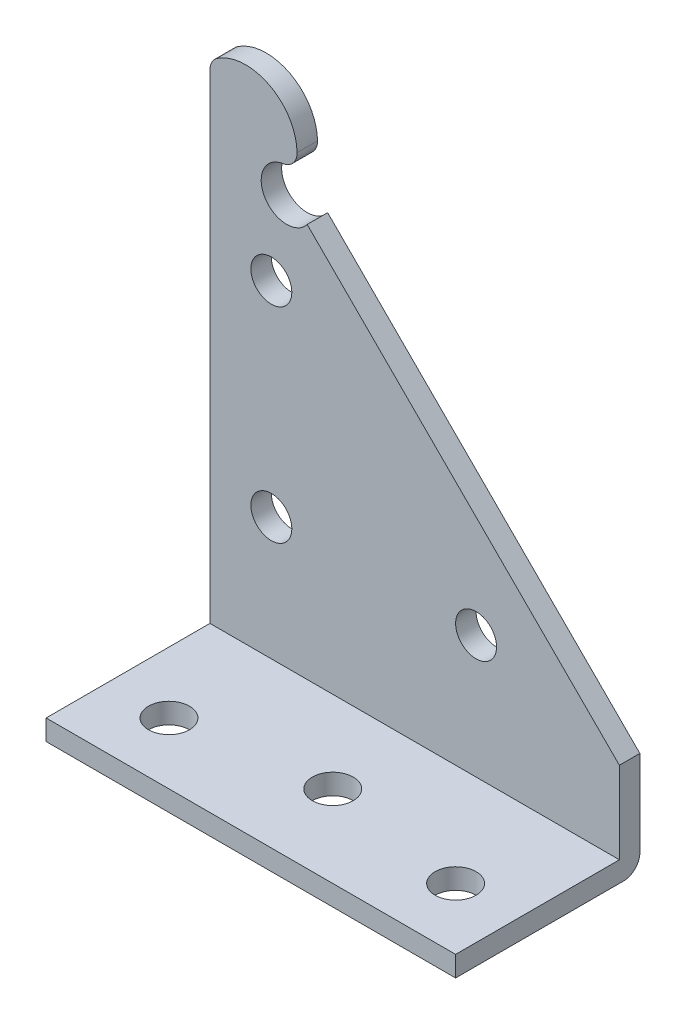
ISO-10303-21;
HEADER;
FILE_DESCRIPTION(('STEP AP214'),'2;1');
FILE_NAME('part.step','',(''),(''),'','','');
FILE_SCHEMA(('AUTOMOTIVE_DESIGN { 1 0 10303 214 1 1 1 1 }'));
ENDSEC;
DATA;
#1=APPLICATION_CONTEXT('core data for automotive mechanical design processes');
#2=APPLICATION_PROTOCOL_DEFINITION('international standard','automotive_design',2000,#1);
#3=PRODUCT_CONTEXT('',#1,'mechanical');
#4=PRODUCT('Part','Part','',(#3));
#5=PRODUCT_RELATED_PRODUCT_CATEGORY('part','',(#4));
#6=PRODUCT_DEFINITION_FORMATION('','',#4);
#7=PRODUCT_DEFINITION_CONTEXT('part definition',#1,'design');
#8=PRODUCT_DEFINITION('design','',#6,#7);
#9=PRODUCT_DEFINITION_SHAPE('','',#8);
#10=(LENGTH_UNIT() NAMED_UNIT(*) SI_UNIT(.MILLI.,.METRE.));
#11=(NAMED_UNIT(*) PLANE_ANGLE_UNIT() SI_UNIT($,.RADIAN.));
#12=(NAMED_UNIT(*) SI_UNIT($,.STERADIAN.) SOLID_ANGLE_UNIT());
#13=UNCERTAINTY_MEASURE_WITH_UNIT(LENGTH_MEASURE(1.E-05),#10,'distance_accuracy_value','');
#14=(GEOMETRIC_REPRESENTATION_CONTEXT(3) GLOBAL_UNCERTAINTY_ASSIGNED_CONTEXT((#13)) GLOBAL_UNIT_ASSIGNED_CONTEXT((#10,
#11,#12)) REPRESENTATION_CONTEXT('',''));
#15=CARTESIAN_POINT('',(0.,0.,0.));
#16=DIRECTION('',(0.,0.,1.));
#17=DIRECTION('',(1.,0.,0.));
#18=AXIS2_PLACEMENT_3D('',#15,#16,#17);
#19=CARTESIAN_POINT('',(-29.3624,44.45,3.175));
#20=DIRECTION('',(0.,0.,1.));
#21=DIRECTION('',(1.,0.,0.));
#22=AXIS2_PLACEMENT_3D('',#19,#20,#21);
#23=PLANE('',#22);
#24=DIRECTION('',(-1.,0.,0.));
#25=VECTOR('',#24,1.);
#26=CARTESIAN_POINT('',(-41.275,-19.05,3.175));
#27=LINE('',#26,#25);
#28=CARTESIAN_POINT('',(22.225,-19.05,3.175));
#29=VERTEX_POINT('',#28);
#30=CARTESIAN_POINT('',(-41.275,-19.05,3.175));
#31=VERTEX_POINT('',#30);
#32=EDGE_CURVE('E136',#29,#31,#27,.T.);
#33=ORIENTED_EDGE('',*,*,#32,.F.);
#34=DIRECTION('',(0.,1.,0.));
#35=VECTOR('',#34,1.);
#36=CARTESIAN_POINT('',(22.225,-22.225,3.175));
#37=LINE('',#36,#35);
#38=CARTESIAN_POINT('',(22.225,-6.34999999999999,3.175));
#39=VERTEX_POINT('',#38);
#40=EDGE_CURVE('E168',#29,#39,#37,.T.);
#41=ORIENTED_EDGE('',*,*,#40,.T.);
#42=DIRECTION('',(-0.707106781186551,0.707106781186544,0.));
#43=VECTOR('',#42,1.);
#44=CARTESIAN_POINT('',(22.225,-6.34999999999999,3.175));
#45=LINE('',#44,#43);
#46=CARTESIAN_POINT('',(-26.1946583294408,42.0696583294403,3.175));
#47=VERTEX_POINT('',#46);
#48=EDGE_CURVE('E170',#39,#47,#45,.T.);
#49=ORIENTED_EDGE('',*,*,#48,.T.);
#50=CARTESIAN_POINT('',(-29.3624,44.45,3.175));
#51=DIRECTION('',(0.,0.,-1.));
#52=DIRECTION('',(1.,0.,0.));
#53=AXIS2_PLACEMENT_3D('',#50,#51,#52);
#54=CIRCLE('',#53,3.9624);
#55=CARTESIAN_POINT('',(-29.9354883165363,48.3707376272137,3.175));
#56=VERTEX_POINT('',#55);
#57=EDGE_CURVE('E173',#47,#56,#54,.T.);
#58=ORIENTED_EDGE('',*,*,#57,.T.);
#59=CARTESIAN_POINT('',(-30.3028526220082,50.8840309779918,3.175));
#60=DIRECTION('',(0.,0.,1.));
#61=DIRECTION('',(1.,0.,0.));
#62=AXIS2_PLACEMENT_3D('',#59,#60,#61);
#63=CIRCLE('',#62,2.54);
#64=CARTESIAN_POINT('',(-27.7631590173173,50.9234821413682,3.175));
#65=VERTEX_POINT('',#64);
#66=EDGE_CURVE('E175',#56,#65,#63,.T.);
#67=ORIENTED_EDGE('',*,*,#66,.T.);
#68=CARTESIAN_POINT('',(-35.7124,50.8,3.175));
#69=DIRECTION('',(0.,0.,1.));
#70=DIRECTION('',(1.,0.,0.));
#71=AXIS2_PLACEMENT_3D('',#68,#69,#70);
#72=CIRCLE('',#71,7.95019999999999);
#73=CARTESIAN_POINT('',(-40.1540610328639,57.3937339428535,3.175));
#74=VERTEX_POINT('',#73);
#75=EDGE_CURVE('E177',#65,#74,#72,.T.);
#76=ORIENTED_EDGE('',*,*,#75,.T.);
#77=CARTESIAN_POINT('',(-38.735,55.287109679961,3.175));
#78=DIRECTION('',(0.,0.,1.));
#79=DIRECTION('',(-1.,0.,0.));
#80=AXIS2_PLACEMENT_3D('',#77,#78,#79);
#81=CIRCLE('',#80,2.54);
#82=CARTESIAN_POINT('',(-41.275,55.287109679961,3.175));
#83=VERTEX_POINT('',#82);
#84=EDGE_CURVE('E179',#74,#83,#81,.T.);
#85=ORIENTED_EDGE('',*,*,#84,.T.);
#86=DIRECTION('',(0.,-1.,0.));
#87=VECTOR('',#86,1.);
#88=CARTESIAN_POINT('',(-41.275,55.287109679961,3.175));
#89=LINE('',#88,#87);
#90=EDGE_CURVE('E181',#83,#31,#89,.T.);
#91=ORIENTED_EDGE('',*,*,#90,.T.);
#92=EDGE_LOOP('',(#33,#41,#49,#58,#67,#76,#85,#91));
#93=FACE_BOUND('',#92,.T.);
#94=CARTESIAN_POINT('',(-31.75,0.,3.175));
#95=DIRECTION('',(0.,0.,1.));
#96=DIRECTION('',(1.,0.,0.));
#97=AXIS2_PLACEMENT_3D('',#94,#95,#96);
#98=CIRCLE('',#97,3.175);
#99=CARTESIAN_POINT('',(-28.575,0.,3.175));
#100=VERTEX_POINT('',#99);
#101=EDGE_CURVE('E156',#100,#100,#98,.T.);
#102=ORIENTED_EDGE('',*,*,#101,.F.);
#103=EDGE_LOOP('',(#102));
#104=FACE_BOUND('',#103,.T.);
#105=CARTESIAN_POINT('',(0.,0.,3.175));
#106=DIRECTION('',(0.,0.,1.));
#107=DIRECTION('',(1.,0.,0.));
#108=AXIS2_PLACEMENT_3D('',#105,#106,#107);
#109=CIRCLE('',#108,3.175);
#110=CARTESIAN_POINT('',(3.175,0.,3.175));
#111=VERTEX_POINT('',#110);
#112=EDGE_CURVE('E162',#111,#111,#109,.T.);
#113=ORIENTED_EDGE('',*,*,#112,.F.);
#114=EDGE_LOOP('',(#113));
#115=FACE_BOUND('',#114,.T.);
#116=CARTESIAN_POINT('',(-31.75,31.75,3.175));
#117=DIRECTION('',(0.,0.,1.));
#118=DIRECTION('',(1.,0.,0.));
#119=AXIS2_PLACEMENT_3D('',#116,#117,#118);
#120=CIRCLE('',#119,3.175);
#121=CARTESIAN_POINT('',(-28.575,31.75,3.175));
#122=VERTEX_POINT('',#121);
#123=EDGE_CURVE('E148',#122,#122,#120,.T.);
#124=ORIENTED_EDGE('',*,*,#123,.F.);
#125=EDGE_LOOP('',(#124));
#126=FACE_BOUND('',#125,.T.);
#127=ADVANCED_FACE('F36',(#93,#104,#115,#126),#23,.T.);
#128=CARTESIAN_POINT('',(-29.3624,44.45,0.));
#129=DIRECTION('',(0.,0.,1.));
#130=DIRECTION('',(1.,0.,0.));
#131=AXIS2_PLACEMENT_3D('',#128,#129,#130);
#132=PLANE('',#131);
#133=DIRECTION('',(0.,1.,0.));
#134=VECTOR('',#133,1.);
#135=CARTESIAN_POINT('',(22.225,-22.225,0.));
#136=LINE('',#135,#134);
#137=CARTESIAN_POINT('',(22.225,-19.685,0.));
#138=VERTEX_POINT('',#137);
#139=CARTESIAN_POINT('',(22.225,-6.34999999999999,0.));
#140=VERTEX_POINT('',#139);
#141=EDGE_CURVE('E165',#138,#140,#136,.T.);
#142=ORIENTED_EDGE('',*,*,#141,.F.);
#143=DIRECTION('',(1.,0.,0.));
#144=VECTOR('',#143,1.);
#145=CARTESIAN_POINT('',(-29.3624,-19.685,0.));
#146=LINE('',#145,#144);
#147=CARTESIAN_POINT('',(-41.275,-19.685,0.));
#148=VERTEX_POINT('',#147);
#149=EDGE_CURVE('E44',#138,#148,#146,.F.);
#150=ORIENTED_EDGE('',*,*,#149,.T.);
#151=DIRECTION('',(0.,-1.,0.));
#152=VECTOR('',#151,1.);
#153=CARTESIAN_POINT('',(-41.275,55.287109679961,0.));
#154=LINE('',#153,#152);
#155=CARTESIAN_POINT('',(-41.275,55.287109679961,0.));
#156=VERTEX_POINT('',#155);
#157=EDGE_CURVE('E171',#156,#148,#154,.T.);
#158=ORIENTED_EDGE('',*,*,#157,.F.);
#159=CARTESIAN_POINT('',(-38.735,55.287109679961,0.));
#160=DIRECTION('',(0.,0.,1.));
#161=DIRECTION('',(-1.,0.,0.));
#162=AXIS2_PLACEMENT_3D('',#159,#160,#161);
#163=CIRCLE('',#162,2.54);
#164=CARTESIAN_POINT('',(-40.1540610328639,57.3937339428535,0.));
#165=VERTEX_POINT('',#164);
#166=EDGE_CURVE('E193',#165,#156,#163,.T.);
#167=ORIENTED_EDGE('',*,*,#166,.F.);
#168=CARTESIAN_POINT('',(-35.7124,50.8,0.));
#169=DIRECTION('',(0.,0.,1.));
#170=DIRECTION('',(1.,0.,0.));
#171=AXIS2_PLACEMENT_3D('',#168,#169,#170);
#172=CIRCLE('',#171,7.95019999999999);
#173=CARTESIAN_POINT('',(-27.7631590173173,50.9234821413682,0.));
#174=VERTEX_POINT('',#173);
#175=EDGE_CURVE('E191',#174,#165,#172,.T.);
#176=ORIENTED_EDGE('',*,*,#175,.F.);
#177=CARTESIAN_POINT('',(-30.3028526220082,50.8840309779918,0.));
#178=DIRECTION('',(0.,0.,1.));
#179=DIRECTION('',(1.,0.,0.));
#180=AXIS2_PLACEMENT_3D('',#177,#178,#179);
#181=CIRCLE('',#180,2.54);
#182=CARTESIAN_POINT('',(-29.9354883165363,48.3707376272137,0.));
#183=VERTEX_POINT('',#182);
#184=EDGE_CURVE('E189',#183,#174,#181,.T.);
#185=ORIENTED_EDGE('',*,*,#184,.F.);
#186=CARTESIAN_POINT('',(-29.3624,44.45,0.));
#187=DIRECTION('',(0.,0.,-1.));
#188=DIRECTION('',(1.,0.,0.));
#189=AXIS2_PLACEMENT_3D('',#186,#187,#188);
#190=CIRCLE('',#189,3.9624);
#191=CARTESIAN_POINT('',(-26.1946583294408,42.0696583294403,0.));
#192=VERTEX_POINT('',#191);
#193=EDGE_CURVE('E187',#192,#183,#190,.T.);
#194=ORIENTED_EDGE('',*,*,#193,.F.);
#195=DIRECTION('',(-0.707106781186551,0.707106781186544,0.));
#196=VECTOR('',#195,1.);
#197=CARTESIAN_POINT('',(22.225,-6.34999999999999,0.));
#198=LINE('',#197,#196);
#199=EDGE_CURVE('E185',#140,#192,#198,.T.);
#200=ORIENTED_EDGE('',*,*,#199,.F.);
#201=EDGE_LOOP('',(#142,#150,#158,#167,#176,#185,#194,#200));
#202=FACE_BOUND('',#201,.T.);
#203=CARTESIAN_POINT('',(0.,0.,0.));
#204=DIRECTION('',(0.,0.,1.));
#205=DIRECTION('',(1.,0.,0.));
#206=AXIS2_PLACEMENT_3D('',#203,#204,#205);
#207=CIRCLE('',#206,3.175);
#208=CARTESIAN_POINT('',(3.175,0.,0.));
#209=VERTEX_POINT('',#208);
#210=EDGE_CURVE('E159',#209,#209,#207,.T.);
#211=ORIENTED_EDGE('',*,*,#210,.T.);
#212=EDGE_LOOP('',(#211));
#213=FACE_BOUND('',#212,.T.);
#214=CARTESIAN_POINT('',(-31.75,0.,0.));
#215=DIRECTION('',(0.,0.,1.));
#216=DIRECTION('',(1.,0.,0.));
#217=AXIS2_PLACEMENT_3D('',#214,#215,#216);
#218=CIRCLE('',#217,3.175);
#219=CARTESIAN_POINT('',(-28.575,0.,0.));
#220=VERTEX_POINT('',#219);
#221=EDGE_CURVE('E154',#220,#220,#218,.T.);
#222=ORIENTED_EDGE('',*,*,#221,.T.);
#223=EDGE_LOOP('',(#222));
#224=FACE_BOUND('',#223,.T.);
#225=CARTESIAN_POINT('',(-31.75,31.75,0.));
#226=DIRECTION('',(0.,0.,1.));
#227=DIRECTION('',(1.,0.,0.));
#228=AXIS2_PLACEMENT_3D('',#225,#226,#227);
#229=CIRCLE('',#228,3.175);
#230=CARTESIAN_POINT('',(-28.575,31.75,0.));
#231=VERTEX_POINT('',#230);
#232=EDGE_CURVE('E145',#231,#231,#229,.T.);
#233=ORIENTED_EDGE('',*,*,#232,.T.);
#234=EDGE_LOOP('',(#233));
#235=FACE_BOUND('',#234,.T.);
#236=ADVANCED_FACE('F271',(#202,#213,#224,#235),#132,.F.);
#237=CARTESIAN_POINT('',(22.225,-22.225,3.175));
#238=DIRECTION('',(-1.,0.,0.));
#239=DIRECTION('',(0.,0.,1.));
#240=AXIS2_PLACEMENT_3D('',#237,#238,#239);
#241=PLANE('',#240);
#242=DIRECTION('',(0.,0.,-1.));
#243=VECTOR('',#242,1.);
#244=CARTESIAN_POINT('',(22.225,-22.225,3.175));
#245=LINE('',#244,#243);
#246=CARTESIAN_POINT('',(22.225,-22.225,28.575));
#247=VERTEX_POINT('',#246);
#248=CARTESIAN_POINT('',(22.225,-22.225,2.54));
#249=VERTEX_POINT('',#248);
#250=EDGE_CURVE('E183',#247,#249,#245,.T.);
#251=ORIENTED_EDGE('',*,*,#250,.T.);
#252=CARTESIAN_POINT('',(22.225,-19.685,2.54));
#253=DIRECTION('',(-1.,0.,0.));
#254=DIRECTION('',(0.,0.,1.));
#255=AXIS2_PLACEMENT_3D('',#252,#253,#254);
#256=CIRCLE('',#255,2.54);
#257=EDGE_CURVE('E58',#249,#138,#256,.F.);
#258=ORIENTED_EDGE('',*,*,#257,.T.);
#259=ORIENTED_EDGE('',*,*,#141,.T.);
#260=DIRECTION('',(0.,0.,-1.));
#261=VECTOR('',#260,1.);
#262=CARTESIAN_POINT('',(22.225,-6.34999999999999,3.175));
#263=LINE('',#262,#261);
#264=EDGE_CURVE('E213',#39,#140,#263,.T.);
#265=ORIENTED_EDGE('',*,*,#264,.F.);
#266=ORIENTED_EDGE('',*,*,#40,.F.);
#267=DIRECTION('',(0.,0.,-1.));
#268=VECTOR('',#267,1.);
#269=CARTESIAN_POINT('',(22.225,-19.05,3.175));
#270=LINE('',#269,#268);
#271=CARTESIAN_POINT('',(22.225,-19.05,28.575));
#272=VERTEX_POINT('',#271);
#273=EDGE_CURVE('E129',#272,#29,#270,.T.);
#274=ORIENTED_EDGE('',*,*,#273,.F.);
#275=DIRECTION('',(0.,-1.,0.));
#276=VECTOR('',#275,1.);
#277=CARTESIAN_POINT('',(22.225,-19.05,28.575));
#278=LINE('',#277,#276);
#279=EDGE_CURVE('E125',#272,#247,#278,.T.);
#280=ORIENTED_EDGE('',*,*,#279,.T.);
#281=EDGE_LOOP('',(#251,#258,#259,#265,#266,#274,#280));
#282=FACE_BOUND('',#281,.T.);
#283=ADVANCED_FACE('F225',(#282),#241,.F.);
#284=CARTESIAN_POINT('',(22.225,-6.34999999999999,3.175));
#285=DIRECTION('',(-0.707106781186543,-0.707106781186551,0.));
#286=DIRECTION('',(0.707106781186551,-0.707106781186544,0.));
#287=AXIS2_PLACEMENT_3D('',#284,#285,#286);
#288=PLANE('',#287);
#289=ORIENTED_EDGE('',*,*,#199,.T.);
#290=DIRECTION('',(0.,0.,-1.));
#291=VECTOR('',#290,1.);
#292=CARTESIAN_POINT('',(-26.1946583294408,42.0696583294403,3.175));
#293=LINE('',#292,#291);
#294=EDGE_CURVE('E210',#47,#192,#293,.T.);
#295=ORIENTED_EDGE('',*,*,#294,.F.);
#296=ORIENTED_EDGE('',*,*,#48,.F.);
#297=ORIENTED_EDGE('',*,*,#264,.T.);
#298=EDGE_LOOP('',(#289,#295,#296,#297));
#299=FACE_BOUND('',#298,.T.);
#300=ADVANCED_FACE('F302',(#299),#288,.F.);
#301=CARTESIAN_POINT('',(-29.3624,44.45,3.175));
#302=DIRECTION('',(0.,0.,-1.));
#303=DIRECTION('',(-1.,0.,0.));
#304=AXIS2_PLACEMENT_3D('',#301,#302,#303);
#305=CYLINDRICAL_SURFACE('',#304,3.9624);
#306=ORIENTED_EDGE('',*,*,#193,.T.);
#307=DIRECTION('',(0.,0.,-1.));
#308=VECTOR('',#307,1.);
#309=CARTESIAN_POINT('',(-29.9354883165363,48.3707376272137,3.175));
#310=LINE('',#309,#308);
#311=EDGE_CURVE('E207',#56,#183,#310,.T.);
#312=ORIENTED_EDGE('',*,*,#311,.F.);
#313=ORIENTED_EDGE('',*,*,#57,.F.);
#314=ORIENTED_EDGE('',*,*,#294,.T.);
#315=EDGE_LOOP('',(#306,#312,#313,#314));
#316=FACE_BOUND('',#315,.T.);
#317=ADVANCED_FACE('F298',(#316),#305,.F.);
#318=CARTESIAN_POINT('',(-30.3028526220082,50.8840309779918,3.175));
#319=DIRECTION('',(0.,0.,-1.));
#320=DIRECTION('',(-1.,0.,0.));
#321=AXIS2_PLACEMENT_3D('',#318,#319,#320);
#322=CYLINDRICAL_SURFACE('',#321,2.54);
#323=ORIENTED_EDGE('',*,*,#184,.T.);
#324=DIRECTION('',(0.,0.,-1.));
#325=VECTOR('',#324,1.);
#326=CARTESIAN_POINT('',(-27.7631590173173,50.9234821413682,3.175));
#327=LINE('',#326,#325);
#328=EDGE_CURVE('E204',#65,#174,#327,.T.);
#329=ORIENTED_EDGE('',*,*,#328,.F.);
#330=ORIENTED_EDGE('',*,*,#66,.F.);
#331=ORIENTED_EDGE('',*,*,#311,.T.);
#332=EDGE_LOOP('',(#323,#329,#330,#331));
#333=FACE_BOUND('',#332,.T.);
#334=ADVANCED_FACE('F294',(#333),#322,.T.);
#335=CARTESIAN_POINT('',(-35.7124,50.8,3.175));
#336=DIRECTION('',(0.,0.,-1.));
#337=DIRECTION('',(-1.,0.,0.));
#338=AXIS2_PLACEMENT_3D('',#335,#336,#337);
#339=CYLINDRICAL_SURFACE('',#338,7.95019999999999);
#340=ORIENTED_EDGE('',*,*,#175,.T.);
#341=DIRECTION('',(0.,0.,-1.));
#342=VECTOR('',#341,1.);
#343=CARTESIAN_POINT('',(-40.1540610328639,57.3937339428535,3.175));
#344=LINE('',#343,#342);
#345=EDGE_CURVE('E201',#74,#165,#344,.T.);
#346=ORIENTED_EDGE('',*,*,#345,.F.);
#347=ORIENTED_EDGE('',*,*,#75,.F.);
#348=ORIENTED_EDGE('',*,*,#328,.T.);
#349=EDGE_LOOP('',(#340,#346,#347,#348));
#350=FACE_BOUND('',#349,.T.);
#351=ADVANCED_FACE('F290',(#350),#339,.T.);
#352=CARTESIAN_POINT('',(-38.735,55.287109679961,3.175));
#353=DIRECTION('',(0.,0.,-1.));
#354=DIRECTION('',(-1.,0.,0.));
#355=AXIS2_PLACEMENT_3D('',#352,#353,#354);
#356=CYLINDRICAL_SURFACE('',#355,2.54);
#357=ORIENTED_EDGE('',*,*,#166,.T.);
#358=DIRECTION('',(0.,0.,-1.));
#359=VECTOR('',#358,1.);
#360=CARTESIAN_POINT('',(-41.275,55.287109679961,3.175));
#361=LINE('',#360,#359);
#362=EDGE_CURVE('E198',#83,#156,#361,.T.);
#363=ORIENTED_EDGE('',*,*,#362,.F.);
#364=ORIENTED_EDGE('',*,*,#84,.F.);
#365=ORIENTED_EDGE('',*,*,#345,.T.);
#366=EDGE_LOOP('',(#357,#363,#364,#365));
#367=FACE_BOUND('',#366,.T.);
#368=ADVANCED_FACE('F287',(#367),#356,.T.);
#369=CARTESIAN_POINT('',(-41.275,55.287109679961,3.175));
#370=DIRECTION('',(1.,0.,0.));
#371=DIRECTION('',(0.,0.,-1.));
#372=AXIS2_PLACEMENT_3D('',#369,#370,#371);
#373=PLANE('',#372);
#374=ORIENTED_EDGE('',*,*,#157,.T.);
#375=CARTESIAN_POINT('',(-41.275,-19.685,2.54));
#376=DIRECTION('',(1.,0.,0.));
#377=DIRECTION('',(0.,0.,-1.));
#378=AXIS2_PLACEMENT_3D('',#375,#376,#377);
#379=CIRCLE('',#378,2.54);
#380=CARTESIAN_POINT('',(-41.275,-22.225,2.54));
#381=VERTEX_POINT('',#380);
#382=EDGE_CURVE('E11',#148,#381,#379,.F.);
#383=ORIENTED_EDGE('',*,*,#382,.T.);
#384=DIRECTION('',(0.,0.,-1.));
#385=VECTOR('',#384,1.);
#386=CARTESIAN_POINT('',(-41.275,-22.225,3.175));
#387=LINE('',#386,#385);
#388=CARTESIAN_POINT('',(-41.275,-22.225,28.575));
#389=VERTEX_POINT('',#388);
#390=EDGE_CURVE('E143',#389,#381,#387,.T.);
#391=ORIENTED_EDGE('',*,*,#390,.F.);
#392=DIRECTION('',(0.,-1.,0.));
#393=VECTOR('',#392,1.);
#394=CARTESIAN_POINT('',(-41.275,-19.05,28.575));
#395=LINE('',#394,#393);
#396=CARTESIAN_POINT('',(-41.275,-19.05,28.575));
#397=VERTEX_POINT('',#396);
#398=EDGE_CURVE('E123',#397,#389,#395,.T.);
#399=ORIENTED_EDGE('',*,*,#398,.F.);
#400=DIRECTION('',(0.,0.,1.));
#401=VECTOR('',#400,1.);
#402=CARTESIAN_POINT('',(-41.275,-19.05,3.175));
#403=LINE('',#402,#401);
#404=EDGE_CURVE('E130',#31,#397,#403,.T.);
#405=ORIENTED_EDGE('',*,*,#404,.F.);
#406=ORIENTED_EDGE('',*,*,#90,.F.);
#407=ORIENTED_EDGE('',*,*,#362,.T.);
#408=EDGE_LOOP('',(#374,#383,#391,#399,#405,#406,#407));
#409=FACE_BOUND('',#408,.T.);
#410=ADVANCED_FACE('F141',(#409),#373,.F.);
#411=CARTESIAN_POINT('',(-41.275,-22.225,3.175));
#412=DIRECTION('',(0.,1.,0.));
#413=DIRECTION('',(-1.,0.,0.));
#414=AXIS2_PLACEMENT_3D('',#411,#412,#413);
#415=PLANE('',#414);
#416=ORIENTED_EDGE('',*,*,#390,.T.);
#417=DIRECTION('',(1.,0.,0.));
#418=VECTOR('',#417,1.);
#419=CARTESIAN_POINT('',(-41.275,-22.225,2.54));
#420=LINE('',#419,#418);
#421=EDGE_CURVE('E216',#381,#249,#420,.T.);
#422=ORIENTED_EDGE('',*,*,#421,.T.);
#423=ORIENTED_EDGE('',*,*,#250,.F.);
#424=DIRECTION('',(1.,0.,0.));
#425=VECTOR('',#424,1.);
#426=CARTESIAN_POINT('',(-41.275,-22.225,28.575));
#427=LINE('',#426,#425);
#428=EDGE_CURVE('E139',#389,#247,#427,.T.);
#429=ORIENTED_EDGE('',*,*,#428,.F.);
#430=EDGE_LOOP('',(#416,#422,#423,#429));
#431=FACE_BOUND('',#430,.T.);
#432=CARTESIAN_POINT('',(-9.525,-22.225,15.875));
#433=DIRECTION('',(0.,1.,0.));
#434=DIRECTION('',(0.,0.,1.));
#435=AXIS2_PLACEMENT_3D('',#432,#433,#434);
#436=CIRCLE('',#435,3.175);
#437=CARTESIAN_POINT('',(-9.525,-22.225,19.05));
#438=VERTEX_POINT('',#437);
#439=EDGE_CURVE('E232',#438,#438,#436,.T.);
#440=ORIENTED_EDGE('',*,*,#439,.T.);
#441=EDGE_LOOP('',(#440));
#442=FACE_BOUND('',#441,.T.);
#443=CARTESIAN_POINT('',(-31.75,-22.225,19.05));
#444=DIRECTION('',(0.,1.,0.));
#445=DIRECTION('',(0.,0.,1.));
#446=AXIS2_PLACEMENT_3D('',#443,#444,#445);
#447=CIRCLE('',#446,3.175);
#448=CARTESIAN_POINT('',(-31.75,-22.225,22.225));
#449=VERTEX_POINT('',#448);
#450=EDGE_CURVE('E240',#449,#449,#447,.T.);
#451=ORIENTED_EDGE('',*,*,#450,.T.);
#452=EDGE_LOOP('',(#451));
#453=FACE_BOUND('',#452,.T.);
#454=CARTESIAN_POINT('',(12.7,-22.225,19.05));
#455=DIRECTION('',(0.,1.,0.));
#456=DIRECTION('',(0.,0.,1.));
#457=AXIS2_PLACEMENT_3D('',#454,#455,#456);
#458=CIRCLE('',#457,3.175);
#459=CARTESIAN_POINT('',(12.7,-22.225,22.225));
#460=VERTEX_POINT('',#459);
#461=EDGE_CURVE('E246',#460,#460,#458,.T.);
#462=ORIENTED_EDGE('',*,*,#461,.T.);
#463=EDGE_LOOP('',(#462));
#464=FACE_BOUND('',#463,.T.);
#465=ADVANCED_FACE('F221',(#431,#442,#453,#464),#415,.F.);
#466=CARTESIAN_POINT('',(0.,0.,3.175));
#467=DIRECTION('',(0.,0.,-1.));
#468=DIRECTION('',(-1.,0.,0.));
#469=AXIS2_PLACEMENT_3D('',#466,#467,#468);
#470=CYLINDRICAL_SURFACE('',#469,3.175);
#471=ORIENTED_EDGE('',*,*,#112,.T.);
#472=EDGE_LOOP('',(#471));
#473=FACE_BOUND('',#472,.T.);
#474=ORIENTED_EDGE('',*,*,#210,.F.);
#475=EDGE_LOOP('',(#474));
#476=FACE_BOUND('',#475,.T.);
#477=ADVANCED_FACE('F280',(#473,#476),#470,.F.);
#478=CARTESIAN_POINT('',(-31.75,0.,3.175));
#479=DIRECTION('',(0.,0.,-1.));
#480=DIRECTION('',(-1.,0.,0.));
#481=AXIS2_PLACEMENT_3D('',#478,#479,#480);
#482=CYLINDRICAL_SURFACE('',#481,3.175);
#483=ORIENTED_EDGE('',*,*,#101,.T.);
#484=EDGE_LOOP('',(#483));
#485=FACE_BOUND('',#484,.T.);
#486=ORIENTED_EDGE('',*,*,#221,.F.);
#487=EDGE_LOOP('',(#486));
#488=FACE_BOUND('',#487,.T.);
#489=ADVANCED_FACE('F265',(#485,#488),#482,.F.);
#490=CARTESIAN_POINT('',(-31.75,31.75,3.175));
#491=DIRECTION('',(0.,0.,-1.));
#492=DIRECTION('',(-1.,0.,0.));
#493=AXIS2_PLACEMENT_3D('',#490,#491,#492);
#494=CYLINDRICAL_SURFACE('',#493,3.175);
#495=ORIENTED_EDGE('',*,*,#123,.T.);
#496=EDGE_LOOP('',(#495));
#497=FACE_BOUND('',#496,.T.);
#498=ORIENTED_EDGE('',*,*,#232,.F.);
#499=EDGE_LOOP('',(#498));
#500=FACE_BOUND('',#499,.T.);
#501=ADVANCED_FACE('F256',(#497,#500),#494,.F.);
#502=CARTESIAN_POINT('',(0.,-19.05,0.));
#503=DIRECTION('',(0.,1.,0.));
#504=DIRECTION('',(0.,0.,1.));
#505=AXIS2_PLACEMENT_3D('',#502,#503,#504);
#506=PLANE('',#505);
#507=CARTESIAN_POINT('',(-31.75,-19.05,19.05));
#508=DIRECTION('',(0.,1.,0.));
#509=DIRECTION('',(0.,0.,1.));
#510=AXIS2_PLACEMENT_3D('',#507,#508,#509);
#511=CIRCLE('',#510,3.175);
#512=CARTESIAN_POINT('',(-31.75,-19.05,22.225));
#513=VERTEX_POINT('',#512);
#514=EDGE_CURVE('E237',#513,#513,#511,.T.);
#515=ORIENTED_EDGE('',*,*,#514,.F.);
#516=EDGE_LOOP('',(#515));
#517=FACE_BOUND('',#516,.T.);
#518=ORIENTED_EDGE('',*,*,#404,.T.);
#519=DIRECTION('',(1.,0.,0.));
#520=VECTOR('',#519,1.);
#521=CARTESIAN_POINT('',(-41.275,-19.05,28.575));
#522=LINE('',#521,#520);
#523=EDGE_CURVE('E118',#397,#272,#522,.T.);
#524=ORIENTED_EDGE('',*,*,#523,.T.);
#525=ORIENTED_EDGE('',*,*,#273,.T.);
#526=ORIENTED_EDGE('',*,*,#32,.T.);
#527=EDGE_LOOP('',(#518,#524,#525,#526));
#528=FACE_BOUND('',#527,.T.);
#529=CARTESIAN_POINT('',(-9.525,-19.05,15.875));
#530=DIRECTION('',(0.,1.,0.));
#531=DIRECTION('',(0.,0.,1.));
#532=AXIS2_PLACEMENT_3D('',#529,#530,#531);
#533=CIRCLE('',#532,3.175);
#534=CARTESIAN_POINT('',(-9.525,-19.05,19.05));
#535=VERTEX_POINT('',#534);
#536=EDGE_CURVE('E230',#535,#535,#533,.T.);
#537=ORIENTED_EDGE('',*,*,#536,.F.);
#538=EDGE_LOOP('',(#537));
#539=FACE_BOUND('',#538,.T.);
#540=CARTESIAN_POINT('',(12.7,-19.05,19.05));
#541=DIRECTION('',(0.,1.,0.));
#542=DIRECTION('',(0.,0.,1.));
#543=AXIS2_PLACEMENT_3D('',#540,#541,#542);
#544=CIRCLE('',#543,3.175);
#545=CARTESIAN_POINT('',(12.7,-19.05,22.225));
#546=VERTEX_POINT('',#545);
#547=EDGE_CURVE('E243',#546,#546,#544,.T.);
#548=ORIENTED_EDGE('',*,*,#547,.F.);
#549=EDGE_LOOP('',(#548));
#550=FACE_BOUND('',#549,.T.);
#551=ADVANCED_FACE('F134',(#517,#528,#539,#550),#506,.T.);
#552=CARTESIAN_POINT('',(-41.275,-19.05,28.575));
#553=DIRECTION('',(0.,0.,-1.));
#554=DIRECTION('',(-1.,0.,0.));
#555=AXIS2_PLACEMENT_3D('',#552,#553,#554);
#556=PLANE('',#555);
#557=ORIENTED_EDGE('',*,*,#428,.T.);
#558=ORIENTED_EDGE('',*,*,#279,.F.);
#559=ORIENTED_EDGE('',*,*,#523,.F.);
#560=ORIENTED_EDGE('',*,*,#398,.T.);
#561=EDGE_LOOP('',(#557,#558,#559,#560));
#562=FACE_BOUND('',#561,.T.);
#563=ADVANCED_FACE('F121',(#562),#556,.F.);
#564=CARTESIAN_POINT('',(-9.525,-19.05,15.875));
#565=DIRECTION('',(0.,-1.,0.));
#566=DIRECTION('',(0.,0.,-1.));
#567=AXIS2_PLACEMENT_3D('',#564,#565,#566);
#568=CYLINDRICAL_SURFACE('',#567,3.175);
#569=ORIENTED_EDGE('',*,*,#536,.T.);
#570=EDGE_LOOP('',(#569));
#571=FACE_BOUND('',#570,.T.);
#572=ORIENTED_EDGE('',*,*,#439,.F.);
#573=EDGE_LOOP('',(#572));
#574=FACE_BOUND('',#573,.T.);
#575=ADVANCED_FACE('F263',(#571,#574),#568,.F.);
#576=CARTESIAN_POINT('',(-31.75,-19.05,19.05));
#577=DIRECTION('',(0.,-1.,0.));
#578=DIRECTION('',(0.,0.,-1.));
#579=AXIS2_PLACEMENT_3D('',#576,#577,#578);
#580=CYLINDRICAL_SURFACE('',#579,3.175);
#581=ORIENTED_EDGE('',*,*,#514,.T.);
#582=EDGE_LOOP('',(#581));
#583=FACE_BOUND('',#582,.T.);
#584=ORIENTED_EDGE('',*,*,#450,.F.);
#585=EDGE_LOOP('',(#584));
#586=FACE_BOUND('',#585,.T.);
#587=ADVANCED_FACE('F380',(#583,#586),#580,.F.);
#588=CARTESIAN_POINT('',(12.7,-19.05,19.05));
#589=DIRECTION('',(0.,-1.,0.));
#590=DIRECTION('',(0.,0.,-1.));
#591=AXIS2_PLACEMENT_3D('',#588,#589,#590);
#592=CYLINDRICAL_SURFACE('',#591,3.175);
#593=ORIENTED_EDGE('',*,*,#547,.T.);
#594=EDGE_LOOP('',(#593));
#595=FACE_BOUND('',#594,.T.);
#596=ORIENTED_EDGE('',*,*,#461,.F.);
#597=EDGE_LOOP('',(#596));
#598=FACE_BOUND('',#597,.T.);
#599=ADVANCED_FACE('F252',(#595,#598),#592,.F.);
#600=CARTESIAN_POINT('',(-41.275,-19.685,2.54));
#601=DIRECTION('',(1.,0.,0.));
#602=DIRECTION('',(0.,1.,0.));
#603=AXIS2_PLACEMENT_3D('',#600,#601,#602);
#604=CYLINDRICAL_SURFACE('',#603,2.54);
#605=ORIENTED_EDGE('',*,*,#382,.F.);
#606=ORIENTED_EDGE('',*,*,#149,.F.);
#607=ORIENTED_EDGE('',*,*,#257,.F.);
#608=ORIENTED_EDGE('',*,*,#421,.F.);
#609=EDGE_LOOP('',(#605,#606,#607,#608));
#610=FACE_BOUND('',#609,.T.);
#611=ADVANCED_FACE('F38',(#610),#604,.T.);
#612=CLOSED_SHELL('',(#127,#236,#283,#300,#317,#334,#351,#368,#410,#465,#477,#489,#501,#551,
#563,#575,#587,#599,#611));
#613=MANIFOLD_SOLID_BREP('B2',#612);
#614=ADVANCED_BREP_SHAPE_REPRESENTATION('',(#18,#613),#14);
#615=SHAPE_DEFINITION_REPRESENTATION(#9,#614);
ENDSEC;
END-ISO-10303-21;
